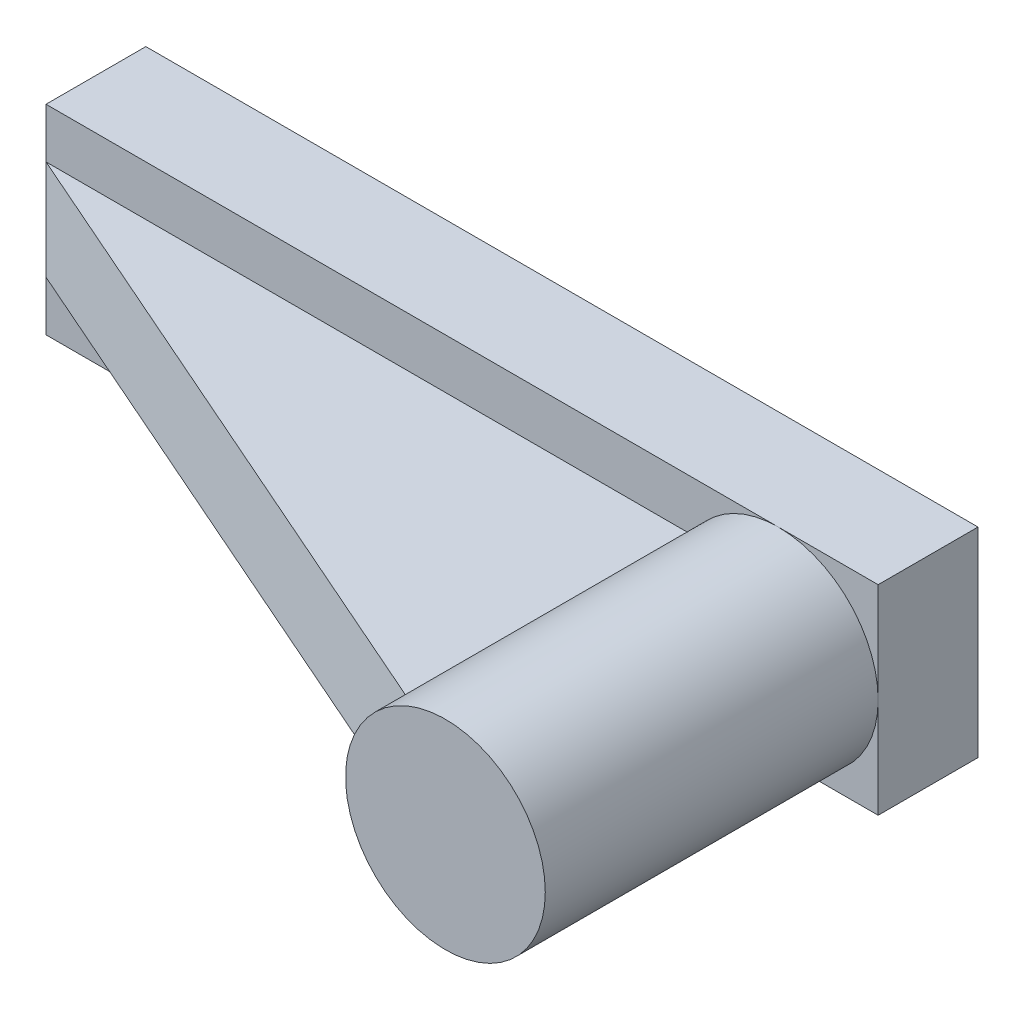
ISO-10303-21;
HEADER;
FILE_DESCRIPTION(('STEP AP214'),'2;1');
FILE_NAME('part.step','',(''),(''),'','','');
FILE_SCHEMA(('AUTOMOTIVE_DESIGN { 1 0 10303 214 1 1 1 1 }'));
ENDSEC;
DATA;
#1=APPLICATION_CONTEXT('core data for automotive mechanical design processes');
#2=APPLICATION_PROTOCOL_DEFINITION('international standard','automotive_design',2000,#1);
#3=PRODUCT_CONTEXT('',#1,'mechanical');
#4=PRODUCT('Part','Part','',(#3));
#5=PRODUCT_RELATED_PRODUCT_CATEGORY('part','',(#4));
#6=PRODUCT_DEFINITION_FORMATION('','',#4);
#7=PRODUCT_DEFINITION_CONTEXT('part definition',#1,'design');
#8=PRODUCT_DEFINITION('design','',#6,#7);
#9=PRODUCT_DEFINITION_SHAPE('','',#8);
#10=(LENGTH_UNIT() NAMED_UNIT(*) SI_UNIT(.MILLI.,.METRE.));
#11=(NAMED_UNIT(*) PLANE_ANGLE_UNIT() SI_UNIT($,.RADIAN.));
#12=(NAMED_UNIT(*) SI_UNIT($,.STERADIAN.) SOLID_ANGLE_UNIT());
#13=UNCERTAINTY_MEASURE_WITH_UNIT(LENGTH_MEASURE(1.E-05),#10,'distance_accuracy_value','');
#14=(GEOMETRIC_REPRESENTATION_CONTEXT(3) GLOBAL_UNCERTAINTY_ASSIGNED_CONTEXT((#13)) GLOBAL_UNIT_ASSIGNED_CONTEXT((#10,
#11,#12)) REPRESENTATION_CONTEXT('',''));
#15=CARTESIAN_POINT('',(0.,0.,0.));
#16=DIRECTION('',(0.,0.,1.));
#17=DIRECTION('',(1.,0.,0.));
#18=AXIS2_PLACEMENT_3D('',#15,#16,#17);
#19=CARTESIAN_POINT('',(0.,30.,0.));
#20=DIRECTION('',(0.,0.,1.));
#21=DIRECTION('',(1.,0.,0.));
#22=AXIS2_PLACEMENT_3D('',#19,#20,#21);
#23=PLANE('',#22);
#24=CARTESIAN_POINT('',(-30.,0.,0.));
#25=DIRECTION('',(0.,0.,1.));
#26=DIRECTION('',(1.,0.,0.));
#27=AXIS2_PLACEMENT_3D('',#24,#25,#26);
#28=CIRCLE('',#27,30.);
#29=CARTESIAN_POINT('',(-55.9807621135331,-15.,0.));
#30=VERTEX_POINT('',#29);
#31=CARTESIAN_POINT('',(-30.,-30.,0.));
#32=VERTEX_POINT('',#31);
#33=EDGE_CURVE('E187',#30,#32,#28,.T.);
#34=ORIENTED_EDGE('',*,*,#33,.F.);
#35=DIRECTION('',(1.,0.,0.));
#36=VECTOR('',#35,1.);
#37=CARTESIAN_POINT('',(-250.,-15.,0.));
#38=LINE('',#37,#36);
#39=CARTESIAN_POINT('',(-250.,-15.,0.));
#40=VERTEX_POINT('',#39);
#41=EDGE_CURVE('E104',#40,#30,#38,.T.);
#42=ORIENTED_EDGE('',*,*,#41,.F.);
#43=DIRECTION('',(0.,-1.,0.));
#44=VECTOR('',#43,1.);
#45=CARTESIAN_POINT('',(-250.,30.,0.));
#46=LINE('',#45,#44);
#47=CARTESIAN_POINT('',(-250.,-30.,0.));
#48=VERTEX_POINT('',#47);
#49=EDGE_CURVE('E208',#40,#48,#46,.T.);
#50=ORIENTED_EDGE('',*,*,#49,.T.);
#51=DIRECTION('',(-1.,0.,0.));
#52=VECTOR('',#51,1.);
#53=CARTESIAN_POINT('',(0.,-30.,0.));
#54=LINE('',#53,#52);
#55=EDGE_CURVE('E211',#32,#48,#54,.T.);
#56=ORIENTED_EDGE('',*,*,#55,.F.);
#57=EDGE_LOOP('',(#34,#42,#50,#56));
#58=FACE_BOUND('',#57,.T.);
#59=ADVANCED_FACE('F89',(#58),#23,.T.);
#60=CARTESIAN_POINT('',(0.,0.,0.));
#61=VERTEX_POINT('',#60);
#62=CARTESIAN_POINT('',(-30.,30.,0.));
#63=VERTEX_POINT('',#62);
#64=EDGE_CURVE('E184',#61,#63,#28,.T.);
#65=ORIENTED_EDGE('',*,*,#64,.F.);
#66=DIRECTION('',(0.,1.,0.));
#67=VECTOR('',#66,1.);
#68=CARTESIAN_POINT('',(0.,-30.,0.));
#69=LINE('',#68,#67);
#70=CARTESIAN_POINT('',(0.,30.,0.));
#71=VERTEX_POINT('',#70);
#72=EDGE_CURVE('E183',#61,#71,#69,.T.);
#73=ORIENTED_EDGE('',*,*,#72,.T.);
#74=DIRECTION('',(-1.,0.,0.));
#75=VECTOR('',#74,1.);
#76=CARTESIAN_POINT('',(0.,30.,0.));
#77=LINE('',#76,#75);
#78=EDGE_CURVE('E205',#71,#63,#77,.T.);
#79=ORIENTED_EDGE('',*,*,#78,.T.);
#80=EDGE_LOOP('',(#65,#73,#79));
#81=FACE_BOUND('',#80,.T.);
#82=ADVANCED_FACE('F234',(#81),#23,.T.);
#83=DIRECTION('',(1.,0.,0.));
#84=VECTOR('',#83,1.);
#85=CARTESIAN_POINT('',(-250.,15.,0.));
#86=LINE('',#85,#84);
#87=CARTESIAN_POINT('',(-250.,15.,0.));
#88=VERTEX_POINT('',#87);
#89=CARTESIAN_POINT('',(-55.9807621135331,15.,0.));
#90=VERTEX_POINT('',#89);
#91=EDGE_CURVE('E174',#88,#90,#86,.T.);
#92=ORIENTED_EDGE('',*,*,#91,.T.);
#93=EDGE_CURVE('E170',#63,#90,#28,.T.);
#94=ORIENTED_EDGE('',*,*,#93,.F.);
#95=CARTESIAN_POINT('',(-250.,30.,0.));
#96=VERTEX_POINT('',#95);
#97=EDGE_CURVE('E204',#63,#96,#77,.T.);
#98=ORIENTED_EDGE('',*,*,#97,.T.);
#99=EDGE_CURVE('E209',#96,#88,#46,.T.);
#100=ORIENTED_EDGE('',*,*,#99,.T.);
#101=EDGE_LOOP('',(#92,#94,#98,#100));
#102=FACE_BOUND('',#101,.T.);
#103=ADVANCED_FACE('F251',(#102),#23,.T.);
#104=CARTESIAN_POINT('',(0.,-30.,-30.));
#105=DIRECTION('',(1.,0.,0.));
#106=DIRECTION('',(0.,0.,-1.));
#107=AXIS2_PLACEMENT_3D('',#104,#105,#106);
#108=PLANE('',#107);
#109=CARTESIAN_POINT('',(0.,-30.,0.));
#110=VERTEX_POINT('',#109);
#111=EDGE_CURVE('E202',#110,#61,#69,.T.);
#112=ORIENTED_EDGE('',*,*,#111,.F.);
#113=DIRECTION('',(0.,0.,1.));
#114=VECTOR('',#113,1.);
#115=CARTESIAN_POINT('',(0.,-30.,-30.));
#116=LINE('',#115,#114);
#117=CARTESIAN_POINT('',(0.,-30.,-30.));
#118=VERTEX_POINT('',#117);
#119=EDGE_CURVE('E214',#118,#110,#116,.T.);
#120=ORIENTED_EDGE('',*,*,#119,.F.);
#121=DIRECTION('',(0.,1.,0.));
#122=VECTOR('',#121,1.);
#123=CARTESIAN_POINT('',(0.,-30.,-30.));
#124=LINE('',#123,#122);
#125=CARTESIAN_POINT('',(0.,30.,-30.));
#126=VERTEX_POINT('',#125);
#127=EDGE_CURVE('E189',#118,#126,#124,.T.);
#128=ORIENTED_EDGE('',*,*,#127,.T.);
#129=DIRECTION('',(0.,0.,1.));
#130=VECTOR('',#129,1.);
#131=CARTESIAN_POINT('',(0.,30.,-30.));
#132=LINE('',#131,#130);
#133=EDGE_CURVE('E201',#126,#71,#132,.T.);
#134=ORIENTED_EDGE('',*,*,#133,.T.);
#135=ORIENTED_EDGE('',*,*,#72,.F.);
#136=EDGE_LOOP('',(#112,#120,#128,#134,#135));
#137=FACE_BOUND('',#136,.T.);
#138=ADVANCED_FACE('F91',(#137),#108,.T.);
#139=CARTESIAN_POINT('',(0.,-30.,-30.));
#140=DIRECTION('',(0.,1.,0.));
#141=DIRECTION('',(-1.,0.,0.));
#142=AXIS2_PLACEMENT_3D('',#139,#140,#141);
#143=PLANE('',#142);
#144=EDGE_CURVE('E193',#110,#32,#54,.T.);
#145=ORIENTED_EDGE('',*,*,#144,.T.);
#146=ORIENTED_EDGE('',*,*,#55,.T.);
#147=DIRECTION('',(0.,0.,1.));
#148=VECTOR('',#147,1.);
#149=CARTESIAN_POINT('',(-250.,-30.,-30.));
#150=LINE('',#149,#148);
#151=CARTESIAN_POINT('',(-250.,-30.,-30.));
#152=VERTEX_POINT('',#151);
#153=EDGE_CURVE('E216',#152,#48,#150,.T.);
#154=ORIENTED_EDGE('',*,*,#153,.F.);
#155=DIRECTION('',(-1.,0.,0.));
#156=VECTOR('',#155,1.);
#157=CARTESIAN_POINT('',(0.,-30.,-30.));
#158=LINE('',#157,#156);
#159=EDGE_CURVE('E199',#118,#152,#158,.T.);
#160=ORIENTED_EDGE('',*,*,#159,.F.);
#161=ORIENTED_EDGE('',*,*,#119,.T.);
#162=EDGE_LOOP('',(#145,#146,#154,#160,#161));
#163=FACE_BOUND('',#162,.T.);
#164=ADVANCED_FACE('F244',(#163),#143,.F.);
#165=CARTESIAN_POINT('',(-250.,30.,-30.));
#166=DIRECTION('',(-1.,0.,0.));
#167=DIRECTION('',(0.,0.,1.));
#168=AXIS2_PLACEMENT_3D('',#165,#166,#167);
#169=PLANE('',#168);
#170=ORIENTED_EDGE('',*,*,#99,.F.);
#171=DIRECTION('',(0.,0.,1.));
#172=VECTOR('',#171,1.);
#173=CARTESIAN_POINT('',(-250.,30.,-30.));
#174=LINE('',#173,#172);
#175=CARTESIAN_POINT('',(-250.,30.,-30.));
#176=VERTEX_POINT('',#175);
#177=EDGE_CURVE('E219',#176,#96,#174,.T.);
#178=ORIENTED_EDGE('',*,*,#177,.F.);
#179=DIRECTION('',(0.,-1.,0.));
#180=VECTOR('',#179,1.);
#181=CARTESIAN_POINT('',(-250.,30.,-30.));
#182=LINE('',#181,#180);
#183=EDGE_CURVE('E196',#176,#152,#182,.T.);
#184=ORIENTED_EDGE('',*,*,#183,.T.);
#185=ORIENTED_EDGE('',*,*,#153,.T.);
#186=ORIENTED_EDGE('',*,*,#49,.F.);
#187=DIRECTION('',(0.,1.,0.));
#188=VECTOR('',#187,1.);
#189=CARTESIAN_POINT('',(-250.,-15.,0.));
#190=LINE('',#189,#188);
#191=EDGE_CURVE('E111',#40,#88,#190,.T.);
#192=ORIENTED_EDGE('',*,*,#191,.T.);
#193=EDGE_LOOP('',(#170,#178,#184,#185,#186,#192));
#194=FACE_BOUND('',#193,.T.);
#195=ADVANCED_FACE('F249',(#194),#169,.T.);
#196=CARTESIAN_POINT('',(0.,30.,-30.));
#197=DIRECTION('',(0.,1.,0.));
#198=DIRECTION('',(-1.,0.,0.));
#199=AXIS2_PLACEMENT_3D('',#196,#197,#198);
#200=PLANE('',#199);
#201=ORIENTED_EDGE('',*,*,#78,.F.);
#202=ORIENTED_EDGE('',*,*,#133,.F.);
#203=DIRECTION('',(-1.,0.,0.));
#204=VECTOR('',#203,1.);
#205=CARTESIAN_POINT('',(0.,30.,-30.));
#206=LINE('',#205,#204);
#207=EDGE_CURVE('E192',#126,#176,#206,.T.);
#208=ORIENTED_EDGE('',*,*,#207,.T.);
#209=ORIENTED_EDGE('',*,*,#177,.T.);
#210=ORIENTED_EDGE('',*,*,#97,.F.);
#211=EDGE_LOOP('',(#201,#202,#208,#209,#210));
#212=FACE_BOUND('',#211,.T.);
#213=ADVANCED_FACE('F232',(#212),#200,.T.);
#214=CARTESIAN_POINT('',(0.,30.,-30.));
#215=DIRECTION('',(0.,0.,1.));
#216=DIRECTION('',(1.,0.,0.));
#217=AXIS2_PLACEMENT_3D('',#214,#215,#216);
#218=PLANE('',#217);
#219=ORIENTED_EDGE('',*,*,#127,.F.);
#220=ORIENTED_EDGE('',*,*,#159,.T.);
#221=ORIENTED_EDGE('',*,*,#183,.F.);
#222=ORIENTED_EDGE('',*,*,#207,.F.);
#223=EDGE_LOOP('',(#219,#220,#221,#222));
#224=FACE_BOUND('',#223,.T.);
#225=ADVANCED_FACE('F248',(#224),#218,.F.);
#226=EDGE_CURVE('E188',#32,#61,#28,.T.);
#227=ORIENTED_EDGE('',*,*,#226,.F.);
#228=ORIENTED_EDGE('',*,*,#144,.F.);
#229=ORIENTED_EDGE('',*,*,#111,.T.);
#230=EDGE_LOOP('',(#227,#228,#229));
#231=FACE_BOUND('',#230,.T.);
#232=ADVANCED_FACE('F240',(#231),#23,.T.);
#233=CARTESIAN_POINT('',(-30.,0.,100.));
#234=DIRECTION('',(0.,0.,-1.));
#235=DIRECTION('',(-1.,0.,0.));
#236=AXIS2_PLACEMENT_3D('',#233,#234,#235);
#237=CYLINDRICAL_SURFACE('',#236,30.);
#238=CARTESIAN_POINT('',(-30.,0.,100.));
#239=DIRECTION('',(0.,0.,1.));
#240=DIRECTION('',(1.,0.,0.));
#241=AXIS2_PLACEMENT_3D('',#238,#239,#240);
#242=CIRCLE('',#241,30.);
#243=CARTESIAN_POINT('',(0.,0.,100.));
#244=VERTEX_POINT('',#243);
#245=EDGE_CURVE('E180',#244,#244,#242,.T.);
#246=ORIENTED_EDGE('',*,*,#245,.F.);
#247=EDGE_LOOP('',(#246));
#248=FACE_BOUND('',#247,.T.);
#249=ORIENTED_EDGE('',*,*,#93,.T.);
#250=DIRECTION('',(0.,0.,-1.));
#251=VECTOR('',#250,1.);
#252=CARTESIAN_POINT('',(-55.9807621135331,15.,100.));
#253=LINE('',#252,#251);
#254=CARTESIAN_POINT('',(-55.9807621135331,15.,85.2663492816841));
#255=VERTEX_POINT('',#254);
#256=EDGE_CURVE('E43',#90,#255,#253,.F.);
#257=ORIENTED_EDGE('',*,*,#256,.T.);
#258=CARTESIAN_POINT('',(-30.,0.,96.6842105263158));
#259=DIRECTION('',(-0.40233489028522,0.,0.915492564720861));
#260=DIRECTION('',(-0.915492564720861,0.,-0.40233489028522));
#261=AXIS2_PLACEMENT_3D('',#258,#259,#260);
#262=ELLIPSE('',#261,32.7692448372283,30.);
#263=CARTESIAN_POINT('',(-55.9807621135331,-15.,85.2663492816841));
#264=VERTEX_POINT('',#263);
#265=EDGE_CURVE('E97',#255,#264,#262,.T.);
#266=ORIENTED_EDGE('',*,*,#265,.T.);
#267=DIRECTION('',(0.,0.,-1.));
#268=VECTOR('',#267,1.);
#269=CARTESIAN_POINT('',(-55.9807621135331,-15.,100.));
#270=LINE('',#269,#268);
#271=EDGE_CURVE('E160',#30,#264,#270,.F.);
#272=ORIENTED_EDGE('',*,*,#271,.F.);
#273=ORIENTED_EDGE('',*,*,#33,.T.);
#274=ORIENTED_EDGE('',*,*,#226,.T.);
#275=ORIENTED_EDGE('',*,*,#64,.T.);
#276=EDGE_LOOP('',(#249,#257,#266,#272,#273,#274,#275));
#277=FACE_BOUND('',#276,.T.);
#278=ADVANCED_FACE('F159',(#248,#277),#237,.T.);
#279=CARTESIAN_POINT('',(-30.,0.,100.));
#280=DIRECTION('',(0.,0.,1.));
#281=DIRECTION('',(1.,0.,0.));
#282=AXIS2_PLACEMENT_3D('',#279,#280,#281);
#283=PLANE('',#282);
#284=ORIENTED_EDGE('',*,*,#245,.T.);
#285=EDGE_LOOP('',(#284));
#286=FACE_BOUND('',#285,.T.);
#287=ADVANCED_FACE('F263',(#286),#283,.T.);
#288=CARTESIAN_POINT('',(-269.086690554202,-50.,-8.38809821724135));
#289=DIRECTION('',(-0.40233489028522,0.,0.915492564720861));
#290=DIRECTION('',(0.915492564720861,0.,0.40233489028522));
#291=AXIS2_PLACEMENT_3D('',#288,#289,#290);
#292=PLANE('',#291);
#293=ORIENTED_EDGE('',*,*,#265,.F.);
#294=DIRECTION('',(0.915492564720861,0.,0.40233489028522));
#295=VECTOR('',#294,1.);
#296=CARTESIAN_POINT('',(-155.883534129194,15.,41.3617100011172));
#297=LINE('',#296,#295);
#298=EDGE_CURVE('E178',#88,#255,#297,.T.);
#299=ORIENTED_EDGE('',*,*,#298,.F.);
#300=ORIENTED_EDGE('',*,*,#191,.F.);
#301=DIRECTION('',(0.915492564720861,0.,0.40233489028522));
#302=VECTOR('',#301,1.);
#303=CARTESIAN_POINT('',(-155.883534129194,-15.,41.3617100011172));
#304=LINE('',#303,#302);
#305=EDGE_CURVE('E169',#40,#264,#304,.T.);
#306=ORIENTED_EDGE('',*,*,#305,.T.);
#307=EDGE_LOOP('',(#293,#299,#300,#306));
#308=FACE_BOUND('',#307,.T.);
#309=ADVANCED_FACE('F172',(#308),#292,.T.);
#310=CARTESIAN_POINT('',(-250.,15.,255.518937731094));
#311=DIRECTION('',(0.,1.,0.));
#312=DIRECTION('',(-1.,0.,0.));
#313=AXIS2_PLACEMENT_3D('',#310,#311,#312);
#314=PLANE('',#313);
#315=ORIENTED_EDGE('',*,*,#256,.F.);
#316=ORIENTED_EDGE('',*,*,#91,.F.);
#317=ORIENTED_EDGE('',*,*,#298,.T.);
#318=EDGE_LOOP('',(#315,#316,#317));
#319=FACE_BOUND('',#318,.T.);
#320=ADVANCED_FACE('F254',(#319),#314,.T.);
#321=CARTESIAN_POINT('',(-250.,-15.,255.518937731094));
#322=DIRECTION('',(0.,1.,0.));
#323=DIRECTION('',(-1.,0.,0.));
#324=AXIS2_PLACEMENT_3D('',#321,#322,#323);
#325=PLANE('',#324);
#326=ORIENTED_EDGE('',*,*,#41,.T.);
#327=ORIENTED_EDGE('',*,*,#271,.T.);
#328=ORIENTED_EDGE('',*,*,#305,.F.);
#329=EDGE_LOOP('',(#326,#327,#328));
#330=FACE_BOUND('',#329,.T.);
#331=ADVANCED_FACE('F168',(#330),#325,.F.);
#332=CLOSED_SHELL('',(#59,#82,#103,#138,#164,#195,#213,#225,#232,#278,#287,#309,#320,#331));
#333=MANIFOLD_SOLID_BREP('B6',#332);
#334=ADVANCED_BREP_SHAPE_REPRESENTATION('',(#18,#333),#14);
#335=SHAPE_DEFINITION_REPRESENTATION(#9,#334);
ENDSEC;
END-ISO-10303-21;
